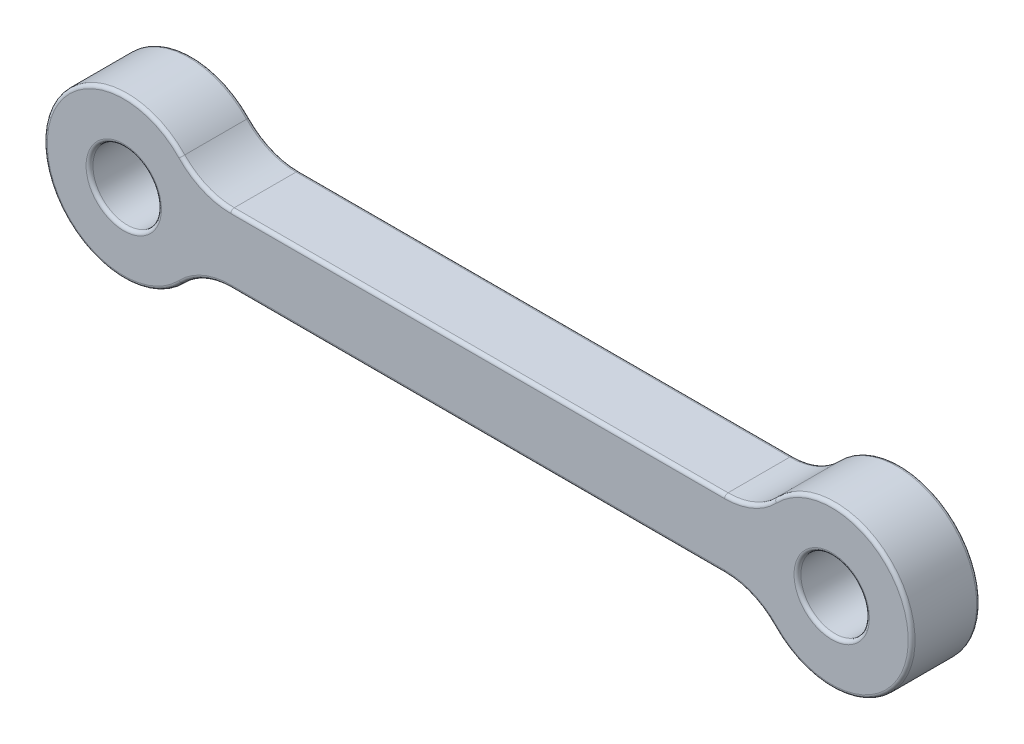
ISO-10303-21;
HEADER;
FILE_DESCRIPTION(('STEP AP214'),'2;1');
FILE_NAME('part.step','',(''),(''),'','','');
FILE_SCHEMA(('AUTOMOTIVE_DESIGN { 1 0 10303 214 1 1 1 1 }'));
ENDSEC;
DATA;
#1=APPLICATION_CONTEXT('core data for automotive mechanical design processes');
#2=APPLICATION_PROTOCOL_DEFINITION('international standard','automotive_design',2000,#1);
#3=PRODUCT_CONTEXT('',#1,'mechanical');
#4=PRODUCT('Part','Part','',(#3));
#5=PRODUCT_RELATED_PRODUCT_CATEGORY('part','',(#4));
#6=PRODUCT_DEFINITION_FORMATION('','',#4);
#7=PRODUCT_DEFINITION_CONTEXT('part definition',#1,'design');
#8=PRODUCT_DEFINITION('design','',#6,#7);
#9=PRODUCT_DEFINITION_SHAPE('','',#8);
#10=(LENGTH_UNIT() NAMED_UNIT(*) SI_UNIT(.MILLI.,.METRE.));
#11=(NAMED_UNIT(*) PLANE_ANGLE_UNIT() SI_UNIT($,.RADIAN.));
#12=(NAMED_UNIT(*) SI_UNIT($,.STERADIAN.) SOLID_ANGLE_UNIT());
#13=UNCERTAINTY_MEASURE_WITH_UNIT(LENGTH_MEASURE(1.E-05),#10,'distance_accuracy_value','');
#14=(GEOMETRIC_REPRESENTATION_CONTEXT(3) GLOBAL_UNCERTAINTY_ASSIGNED_CONTEXT((#13)) GLOBAL_UNIT_ASSIGNED_CONTEXT((#10,
#11,#12)) REPRESENTATION_CONTEXT('',''));
#15=CARTESIAN_POINT('',(0.,0.,0.));
#16=DIRECTION('',(0.,0.,1.));
#17=DIRECTION('',(1.,0.,0.));
#18=AXIS2_PLACEMENT_3D('',#15,#16,#17);
#19=CARTESIAN_POINT('',(0.,1.5,1.5));
#20=DIRECTION('',(0.,1.,0.));
#21=DIRECTION('',(0.,0.,1.));
#22=AXIS2_PLACEMENT_3D('',#19,#20,#21);
#23=PLANE('',#22);
#24=DIRECTION('',(0.,0.,1.));
#25=VECTOR('',#24,1.);
#26=CARTESIAN_POINT('',(26.3095842401766,1.5,-1.5));
#27=LINE('',#26,#25);
#28=CARTESIAN_POINT('',(26.3095842401766,1.5,1.35));
#29=VERTEX_POINT('',#28);
#30=CARTESIAN_POINT('',(26.3095842401766,1.5,-1.35));
#31=VERTEX_POINT('',#30);
#32=EDGE_CURVE('E317',#29,#31,#27,.F.);
#33=ORIENTED_EDGE('',*,*,#32,.T.);
#34=DIRECTION('',(1.,0.,0.));
#35=VECTOR('',#34,1.);
#36=CARTESIAN_POINT('',(4.69041575982343,1.5,-1.35));
#37=LINE('',#36,#35);
#38=CARTESIAN_POINT('',(4.69041575982343,1.5,-1.35));
#39=VERTEX_POINT('',#38);
#40=EDGE_CURVE('E216',#31,#39,#37,.F.);
#41=ORIENTED_EDGE('',*,*,#40,.T.);
#42=DIRECTION('',(0.,0.,-1.));
#43=VECTOR('',#42,1.);
#44=CARTESIAN_POINT('',(4.69041575982343,1.5,1.5));
#45=LINE('',#44,#43);
#46=CARTESIAN_POINT('',(4.69041575982343,1.5,1.35));
#47=VERTEX_POINT('',#46);
#48=EDGE_CURVE('E314',#39,#47,#45,.F.);
#49=ORIENTED_EDGE('',*,*,#48,.T.);
#50=DIRECTION('',(1.,0.,0.));
#51=VECTOR('',#50,1.);
#52=CARTESIAN_POINT('',(0.,1.5,1.35));
#53=LINE('',#52,#51);
#54=EDGE_CURVE('E214',#47,#29,#53,.T.);
#55=ORIENTED_EDGE('',*,*,#54,.T.);
#56=EDGE_LOOP('',(#33,#41,#49,#55));
#57=FACE_BOUND('',#56,.T.);
#58=ADVANCED_FACE('F36',(#57),#23,.T.);
#59=CARTESIAN_POINT('',(0.,0.,1.5));
#60=DIRECTION('',(0.,0.,-1.));
#61=DIRECTION('',(-1.,0.,0.));
#62=AXIS2_PLACEMENT_3D('',#59,#60,#61);
#63=CYLINDRICAL_SURFACE('',#62,3.5);
#64=DIRECTION('',(0.,0.,-1.));
#65=VECTOR('',#64,1.);
#66=CARTESIAN_POINT('',(2.52560848605877,2.42307692307692,1.5));
#67=LINE('',#66,#65);
#68=CARTESIAN_POINT('',(2.52560848605877,2.42307692307692,1.35));
#69=VERTEX_POINT('',#68);
#70=CARTESIAN_POINT('',(2.52560848605877,2.42307692307692,-1.35));
#71=VERTEX_POINT('',#70);
#72=EDGE_CURVE('E304',#69,#71,#67,.T.);
#73=ORIENTED_EDGE('',*,*,#72,.T.);
#74=CARTESIAN_POINT('',(0.,0.,-1.35));
#75=DIRECTION('',(0.,0.,1.));
#76=DIRECTION('',(1.,0.,0.));
#77=AXIS2_PLACEMENT_3D('',#74,#75,#76);
#78=CIRCLE('',#77,3.5);
#79=CARTESIAN_POINT('',(2.52560848605877,-2.42307692307692,-1.35));
#80=VERTEX_POINT('',#79);
#81=EDGE_CURVE('E224',#71,#80,#78,.T.);
#82=ORIENTED_EDGE('',*,*,#81,.T.);
#83=DIRECTION('',(0.,0.,-1.));
#84=VECTOR('',#83,1.);
#85=CARTESIAN_POINT('',(2.52560848605877,-2.42307692307692,1.5));
#86=LINE('',#85,#84);
#87=CARTESIAN_POINT('',(2.52560848605877,-2.42307692307692,1.35));
#88=VERTEX_POINT('',#87);
#89=EDGE_CURVE('E296',#80,#88,#86,.F.);
#90=ORIENTED_EDGE('',*,*,#89,.T.);
#91=CARTESIAN_POINT('',(0.,0.,1.35));
#92=DIRECTION('',(0.,0.,1.));
#93=DIRECTION('',(1.,0.,0.));
#94=AXIS2_PLACEMENT_3D('',#91,#92,#93);
#95=CIRCLE('',#94,3.5);
#96=EDGE_CURVE('E222',#88,#69,#95,.F.);
#97=ORIENTED_EDGE('',*,*,#96,.T.);
#98=EDGE_LOOP('',(#73,#82,#90,#97));
#99=FACE_BOUND('',#98,.T.);
#100=ADVANCED_FACE('F301',(#99),#63,.T.);
#101=CARTESIAN_POINT('',(0.,-1.5,1.5));
#102=DIRECTION('',(0.,1.,0.));
#103=DIRECTION('',(0.,0.,1.));
#104=AXIS2_PLACEMENT_3D('',#101,#102,#103);
#105=PLANE('',#104);
#106=DIRECTION('',(0.,0.,1.));
#107=VECTOR('',#106,1.);
#108=CARTESIAN_POINT('',(4.69041575982343,-1.5,-1.5));
#109=LINE('',#108,#107);
#110=CARTESIAN_POINT('',(4.69041575982343,-1.5,1.35));
#111=VERTEX_POINT('',#110);
#112=CARTESIAN_POINT('',(4.69041575982343,-1.5,-1.35));
#113=VERTEX_POINT('',#112);
#114=EDGE_CURVE('E298',#111,#113,#109,.F.);
#115=ORIENTED_EDGE('',*,*,#114,.T.);
#116=DIRECTION('',(1.,0.,0.));
#117=VECTOR('',#116,1.);
#118=CARTESIAN_POINT('',(0.,-1.5,-1.35));
#119=LINE('',#118,#117);
#120=CARTESIAN_POINT('',(26.3095842401766,-1.5,-1.35));
#121=VERTEX_POINT('',#120);
#122=EDGE_CURVE('E199',#113,#121,#119,.T.);
#123=ORIENTED_EDGE('',*,*,#122,.T.);
#124=DIRECTION('',(0.,0.,-1.));
#125=VECTOR('',#124,1.);
#126=CARTESIAN_POINT('',(26.3095842401766,-1.5,1.5));
#127=LINE('',#126,#125);
#128=CARTESIAN_POINT('',(26.3095842401766,-1.5,1.35));
#129=VERTEX_POINT('',#128);
#130=EDGE_CURVE('E259',#121,#129,#127,.F.);
#131=ORIENTED_EDGE('',*,*,#130,.T.);
#132=DIRECTION('',(1.,0.,0.));
#133=VECTOR('',#132,1.);
#134=CARTESIAN_POINT('',(4.69041575982343,-1.5,1.35));
#135=LINE('',#134,#133);
#136=EDGE_CURVE('E197',#129,#111,#135,.F.);
#137=ORIENTED_EDGE('',*,*,#136,.T.);
#138=EDGE_LOOP('',(#115,#123,#131,#137));
#139=FACE_BOUND('',#138,.T.);
#140=ADVANCED_FACE('F344',(#139),#105,.F.);
#141=CARTESIAN_POINT('',(0.,0.,1.5));
#142=DIRECTION('',(0.,0.,-1.));
#143=DIRECTION('',(-1.,0.,0.));
#144=AXIS2_PLACEMENT_3D('',#141,#142,#143);
#145=CYLINDRICAL_SURFACE('',#144,1.5);
#146=CARTESIAN_POINT('',(0.,0.,-1.35));
#147=DIRECTION('',(0.,0.,1.));
#148=DIRECTION('',(1.,0.,0.));
#149=AXIS2_PLACEMENT_3D('',#146,#147,#148);
#150=CIRCLE('',#149,1.5);
#151=CARTESIAN_POINT('',(1.5,0.,-1.35));
#152=VERTEX_POINT('',#151);
#153=EDGE_CURVE('E191',#152,#152,#150,.F.);
#154=ORIENTED_EDGE('',*,*,#153,.T.);
#155=EDGE_LOOP('',(#154));
#156=FACE_BOUND('',#155,.T.);
#157=CARTESIAN_POINT('',(0.,0.,1.35));
#158=DIRECTION('',(0.,0.,1.));
#159=DIRECTION('',(1.,0.,0.));
#160=AXIS2_PLACEMENT_3D('',#157,#158,#159);
#161=CIRCLE('',#160,1.5);
#162=CARTESIAN_POINT('',(1.5,0.,1.35));
#163=VERTEX_POINT('',#162);
#164=EDGE_CURVE('E188',#163,#163,#161,.T.);
#165=ORIENTED_EDGE('',*,*,#164,.T.);
#166=EDGE_LOOP('',(#165));
#167=FACE_BOUND('',#166,.T.);
#168=ADVANCED_FACE('F391',(#156,#167),#145,.F.);
#169=CARTESIAN_POINT('',(31.,0.,1.5));
#170=DIRECTION('',(0.,0.,-1.));
#171=DIRECTION('',(-1.,0.,0.));
#172=AXIS2_PLACEMENT_3D('',#169,#170,#171);
#173=CYLINDRICAL_SURFACE('',#172,3.5);
#174=DIRECTION('',(0.,0.,-1.));
#175=VECTOR('',#174,1.);
#176=CARTESIAN_POINT('',(28.4743915139412,-2.42307692307692,1.5));
#177=LINE('',#176,#175);
#178=CARTESIAN_POINT('',(28.4743915139412,-2.42307692307692,1.35));
#179=VERTEX_POINT('',#178);
#180=CARTESIAN_POINT('',(28.4743915139412,-2.42307692307692,-1.35));
#181=VERTEX_POINT('',#180);
#182=EDGE_CURVE('E307',#179,#181,#177,.T.);
#183=ORIENTED_EDGE('',*,*,#182,.T.);
#184=CARTESIAN_POINT('',(31.,0.,-1.35));
#185=DIRECTION('',(0.,0.,1.));
#186=DIRECTION('',(1.,0.,0.));
#187=AXIS2_PLACEMENT_3D('',#184,#185,#186);
#188=CIRCLE('',#187,3.5);
#189=CARTESIAN_POINT('',(28.4743915139412,2.42307692307692,-1.35));
#190=VERTEX_POINT('',#189);
#191=EDGE_CURVE('E207',#181,#190,#188,.T.);
#192=ORIENTED_EDGE('',*,*,#191,.T.);
#193=DIRECTION('',(0.,0.,-1.));
#194=VECTOR('',#193,1.);
#195=CARTESIAN_POINT('',(28.4743915139412,2.42307692307692,1.5));
#196=LINE('',#195,#194);
#197=CARTESIAN_POINT('',(28.4743915139412,2.42307692307692,1.35));
#198=VERTEX_POINT('',#197);
#199=EDGE_CURVE('E303',#190,#198,#196,.F.);
#200=ORIENTED_EDGE('',*,*,#199,.T.);
#201=CARTESIAN_POINT('',(31.,0.,1.35));
#202=DIRECTION('',(0.,0.,1.));
#203=DIRECTION('',(1.,0.,0.));
#204=AXIS2_PLACEMENT_3D('',#201,#202,#203);
#205=CIRCLE('',#204,3.5);
#206=EDGE_CURVE('E205',#198,#179,#205,.F.);
#207=ORIENTED_EDGE('',*,*,#206,.T.);
#208=EDGE_LOOP('',(#183,#192,#200,#207));
#209=FACE_BOUND('',#208,.T.);
#210=ADVANCED_FACE('F388',(#209),#173,.T.);
#211=CARTESIAN_POINT('',(31.,0.,1.5));
#212=DIRECTION('',(0.,0.,-1.));
#213=DIRECTION('',(-1.,0.,0.));
#214=AXIS2_PLACEMENT_3D('',#211,#212,#213);
#215=CYLINDRICAL_SURFACE('',#214,1.5);
#216=CARTESIAN_POINT('',(31.,0.,-1.35));
#217=DIRECTION('',(0.,0.,1.));
#218=DIRECTION('',(1.,0.,0.));
#219=AXIS2_PLACEMENT_3D('',#216,#217,#218);
#220=CIRCLE('',#219,1.5);
#221=CARTESIAN_POINT('',(32.5,0.,-1.35));
#222=VERTEX_POINT('',#221);
#223=EDGE_CURVE('E171',#222,#222,#220,.F.);
#224=ORIENTED_EDGE('',*,*,#223,.T.);
#225=EDGE_LOOP('',(#224));
#226=FACE_BOUND('',#225,.T.);
#227=CARTESIAN_POINT('',(31.,0.,1.35));
#228=DIRECTION('',(0.,0.,1.));
#229=DIRECTION('',(1.,0.,0.));
#230=AXIS2_PLACEMENT_3D('',#227,#228,#229);
#231=CIRCLE('',#230,1.5);
#232=CARTESIAN_POINT('',(32.5,0.,1.35));
#233=VERTEX_POINT('',#232);
#234=EDGE_CURVE('E320',#233,#233,#231,.T.);
#235=ORIENTED_EDGE('',*,*,#234,.T.);
#236=EDGE_LOOP('',(#235));
#237=FACE_BOUND('',#236,.T.);
#238=ADVANCED_FACE('F390',(#226,#237),#215,.F.);
#239=CARTESIAN_POINT('',(0.,0.,1.5));
#240=DIRECTION('',(0.,0.,1.));
#241=DIRECTION('',(1.,0.,0.));
#242=AXIS2_PLACEMENT_3D('',#239,#240,#241);
#243=PLANE('',#242);
#244=CARTESIAN_POINT('',(31.,0.,1.5));
#245=DIRECTION('',(0.,0.,1.));
#246=DIRECTION('',(1.,0.,0.));
#247=AXIS2_PLACEMENT_3D('',#244,#245,#246);
#248=CIRCLE('',#247,1.65);
#249=CARTESIAN_POINT('',(32.65,0.,1.5));
#250=VERTEX_POINT('',#249);
#251=EDGE_CURVE('E11',#250,#250,#248,.F.);
#252=ORIENTED_EDGE('',*,*,#251,.T.);
#253=EDGE_LOOP('',(#252));
#254=FACE_BOUND('',#253,.T.);
#255=CARTESIAN_POINT('',(0.,0.,1.5));
#256=DIRECTION('',(0.,0.,1.));
#257=DIRECTION('',(1.,0.,0.));
#258=AXIS2_PLACEMENT_3D('',#255,#256,#257);
#259=CIRCLE('',#258,1.65);
#260=CARTESIAN_POINT('',(1.65,0.,1.5));
#261=VERTEX_POINT('',#260);
#262=EDGE_CURVE('E45',#261,#261,#259,.F.);
#263=ORIENTED_EDGE('',*,*,#262,.T.);
#264=EDGE_LOOP('',(#263));
#265=FACE_BOUND('',#264,.T.);
#266=CARTESIAN_POINT('',(31.,0.,1.5));
#267=DIRECTION('',(0.,0.,1.));
#268=DIRECTION('',(1.,0.,0.));
#269=AXIS2_PLACEMENT_3D('',#266,#267,#268);
#270=CIRCLE('',#269,3.35);
#271=CARTESIAN_POINT('',(28.5826318776295,-2.31923076923077,1.5));
#272=VERTEX_POINT('',#271);
#273=CARTESIAN_POINT('',(28.5826318776295,2.31923076923077,1.5));
#274=VERTEX_POINT('',#273);
#275=EDGE_CURVE('E53',#272,#274,#270,.T.);
#276=ORIENTED_EDGE('',*,*,#275,.T.);
#277=CARTESIAN_POINT('',(26.3095842401766,4.5,1.5));
#278=DIRECTION('',(0.,0.,1.));
#279=DIRECTION('',(1.,0.,0.));
#280=AXIS2_PLACEMENT_3D('',#277,#278,#279);
#281=CIRCLE('',#280,3.15);
#282=CARTESIAN_POINT('',(26.3095842401766,1.35,1.5));
#283=VERTEX_POINT('',#282);
#284=EDGE_CURVE('E238',#274,#283,#281,.F.);
#285=ORIENTED_EDGE('',*,*,#284,.T.);
#286=DIRECTION('',(1.,0.,0.));
#287=VECTOR('',#286,1.);
#288=CARTESIAN_POINT('',(0.,1.35,1.5));
#289=LINE('',#288,#287);
#290=CARTESIAN_POINT('',(4.69041575982343,1.35,1.5));
#291=VERTEX_POINT('',#290);
#292=EDGE_CURVE('E226',#283,#291,#289,.F.);
#293=ORIENTED_EDGE('',*,*,#292,.T.);
#294=CARTESIAN_POINT('',(4.69041575982343,4.5,1.5));
#295=DIRECTION('',(0.,0.,1.));
#296=DIRECTION('',(1.,0.,0.));
#297=AXIS2_PLACEMENT_3D('',#294,#295,#296);
#298=CIRCLE('',#297,3.15);
#299=CARTESIAN_POINT('',(2.41736812237054,2.31923076923077,1.5));
#300=VERTEX_POINT('',#299);
#301=EDGE_CURVE('E228',#291,#300,#298,.F.);
#302=ORIENTED_EDGE('',*,*,#301,.T.);
#303=CARTESIAN_POINT('',(0.,0.,1.5));
#304=DIRECTION('',(0.,0.,1.));
#305=DIRECTION('',(1.,0.,0.));
#306=AXIS2_PLACEMENT_3D('',#303,#304,#305);
#307=CIRCLE('',#306,3.35);
#308=CARTESIAN_POINT('',(2.41736812237054,-2.31923076923077,1.5));
#309=VERTEX_POINT('',#308);
#310=EDGE_CURVE('E230',#300,#309,#307,.T.);
#311=ORIENTED_EDGE('',*,*,#310,.T.);
#312=CARTESIAN_POINT('',(4.69041575982343,-4.5,1.5));
#313=DIRECTION('',(0.,0.,1.));
#314=DIRECTION('',(1.,0.,0.));
#315=AXIS2_PLACEMENT_3D('',#312,#313,#314);
#316=CIRCLE('',#315,3.15);
#317=CARTESIAN_POINT('',(4.69041575982343,-1.35,1.5));
#318=VERTEX_POINT('',#317);
#319=EDGE_CURVE('E232',#309,#318,#316,.F.);
#320=ORIENTED_EDGE('',*,*,#319,.T.);
#321=DIRECTION('',(1.,0.,0.));
#322=VECTOR('',#321,1.);
#323=CARTESIAN_POINT('',(26.3095842401766,-1.35,1.5));
#324=LINE('',#323,#322);
#325=CARTESIAN_POINT('',(26.3095842401766,-1.35,1.5));
#326=VERTEX_POINT('',#325);
#327=EDGE_CURVE('E234',#318,#326,#324,.T.);
#328=ORIENTED_EDGE('',*,*,#327,.T.);
#329=CARTESIAN_POINT('',(26.3095842401766,-4.5,1.5));
#330=DIRECTION('',(0.,0.,1.));
#331=DIRECTION('',(1.,0.,0.));
#332=AXIS2_PLACEMENT_3D('',#329,#330,#331);
#333=CIRCLE('',#332,3.15);
#334=EDGE_CURVE('E58',#326,#272,#333,.F.);
#335=ORIENTED_EDGE('',*,*,#334,.T.);
#336=EDGE_LOOP('',(#276,#285,#293,#302,#311,#320,#328,#335));
#337=FACE_BOUND('',#336,.T.);
#338=ADVANCED_FACE('F361',(#254,#265,#337),#243,.T.);
#339=CARTESIAN_POINT('',(0.,0.,-1.5));
#340=DIRECTION('',(0.,0.,1.));
#341=DIRECTION('',(1.,0.,0.));
#342=AXIS2_PLACEMENT_3D('',#339,#340,#341);
#343=PLANE('',#342);
#344=CARTESIAN_POINT('',(31.,0.,-1.5));
#345=DIRECTION('',(0.,0.,1.));
#346=DIRECTION('',(1.,0.,0.));
#347=AXIS2_PLACEMENT_3D('',#344,#345,#346);
#348=CIRCLE('',#347,1.65);
#349=CARTESIAN_POINT('',(32.65,0.,-1.5));
#350=VERTEX_POINT('',#349);
#351=EDGE_CURVE('E180',#350,#350,#348,.T.);
#352=ORIENTED_EDGE('',*,*,#351,.T.);
#353=EDGE_LOOP('',(#352));
#354=FACE_BOUND('',#353,.T.);
#355=CARTESIAN_POINT('',(0.,0.,-1.5));
#356=DIRECTION('',(0.,0.,1.));
#357=DIRECTION('',(1.,0.,0.));
#358=AXIS2_PLACEMENT_3D('',#355,#356,#357);
#359=CIRCLE('',#358,1.65);
#360=CARTESIAN_POINT('',(1.65,0.,-1.5));
#361=VERTEX_POINT('',#360);
#362=EDGE_CURVE('E177',#361,#361,#359,.T.);
#363=ORIENTED_EDGE('',*,*,#362,.T.);
#364=EDGE_LOOP('',(#363));
#365=FACE_BOUND('',#364,.T.);
#366=DIRECTION('',(1.,0.,0.));
#367=VECTOR('',#366,1.);
#368=CARTESIAN_POINT('',(0.,-1.35,-1.5));
#369=LINE('',#368,#367);
#370=CARTESIAN_POINT('',(26.3095842401766,-1.35,-1.5));
#371=VERTEX_POINT('',#370);
#372=CARTESIAN_POINT('',(4.69041575982343,-1.35,-1.5));
#373=VERTEX_POINT('',#372);
#374=EDGE_CURVE('E175',#371,#373,#369,.F.);
#375=ORIENTED_EDGE('',*,*,#374,.T.);
#376=CARTESIAN_POINT('',(4.69041575982343,-4.5,-1.5));
#377=DIRECTION('',(0.,0.,1.));
#378=DIRECTION('',(1.,0.,0.));
#379=AXIS2_PLACEMENT_3D('',#376,#377,#378);
#380=CIRCLE('',#379,3.15);
#381=CARTESIAN_POINT('',(2.41736812237054,-2.31923076923077,-1.5));
#382=VERTEX_POINT('',#381);
#383=EDGE_CURVE('E156',#373,#382,#380,.T.);
#384=ORIENTED_EDGE('',*,*,#383,.T.);
#385=CARTESIAN_POINT('',(0.,0.,-1.5));
#386=DIRECTION('',(0.,0.,1.));
#387=DIRECTION('',(1.,0.,0.));
#388=AXIS2_PLACEMENT_3D('',#385,#386,#387);
#389=CIRCLE('',#388,3.35);
#390=CARTESIAN_POINT('',(2.41736812237054,2.31923076923077,-1.5));
#391=VERTEX_POINT('',#390);
#392=EDGE_CURVE('E164',#382,#391,#389,.F.);
#393=ORIENTED_EDGE('',*,*,#392,.T.);
#394=CARTESIAN_POINT('',(4.69041575982343,4.5,-1.5));
#395=DIRECTION('',(0.,0.,1.));
#396=DIRECTION('',(1.,0.,0.));
#397=AXIS2_PLACEMENT_3D('',#394,#395,#396);
#398=CIRCLE('',#397,3.15);
#399=CARTESIAN_POINT('',(4.69041575982343,1.35,-1.5));
#400=VERTEX_POINT('',#399);
#401=EDGE_CURVE('E170',#391,#400,#398,.T.);
#402=ORIENTED_EDGE('',*,*,#401,.T.);
#403=DIRECTION('',(1.,0.,0.));
#404=VECTOR('',#403,1.);
#405=CARTESIAN_POINT('',(26.3095842401766,1.35,-1.5));
#406=LINE('',#405,#404);
#407=CARTESIAN_POINT('',(26.3095842401766,1.35,-1.5));
#408=VERTEX_POINT('',#407);
#409=EDGE_CURVE('E326',#400,#408,#406,.T.);
#410=ORIENTED_EDGE('',*,*,#409,.T.);
#411=CARTESIAN_POINT('',(26.3095842401766,4.5,-1.5));
#412=DIRECTION('',(0.,0.,1.));
#413=DIRECTION('',(1.,0.,0.));
#414=AXIS2_PLACEMENT_3D('',#411,#412,#413);
#415=CIRCLE('',#414,3.15);
#416=CARTESIAN_POINT('',(28.5826318776295,2.31923076923077,-1.5));
#417=VERTEX_POINT('',#416);
#418=EDGE_CURVE('E328',#408,#417,#415,.T.);
#419=ORIENTED_EDGE('',*,*,#418,.T.);
#420=CARTESIAN_POINT('',(31.,0.,-1.5));
#421=DIRECTION('',(0.,0.,1.));
#422=DIRECTION('',(1.,0.,0.));
#423=AXIS2_PLACEMENT_3D('',#420,#421,#422);
#424=CIRCLE('',#423,3.35);
#425=CARTESIAN_POINT('',(28.5826318776295,-2.31923076923077,-1.5));
#426=VERTEX_POINT('',#425);
#427=EDGE_CURVE('E330',#417,#426,#424,.F.);
#428=ORIENTED_EDGE('',*,*,#427,.T.);
#429=CARTESIAN_POINT('',(26.3095842401766,-4.5,-1.5));
#430=DIRECTION('',(0.,0.,1.));
#431=DIRECTION('',(1.,0.,0.));
#432=AXIS2_PLACEMENT_3D('',#429,#430,#431);
#433=CIRCLE('',#432,3.15);
#434=EDGE_CURVE('E182',#426,#371,#433,.T.);
#435=ORIENTED_EDGE('',*,*,#434,.T.);
#436=EDGE_LOOP('',(#375,#384,#393,#402,#410,#419,#428,#435));
#437=FACE_BOUND('',#436,.T.);
#438=ADVANCED_FACE('F173',(#354,#365,#437),#343,.F.);
#439=CARTESIAN_POINT('',(4.69041575982343,-4.5,1.5));
#440=DIRECTION('',(0.,0.,-1.));
#441=DIRECTION('',(-1.,0.,0.));
#442=AXIS2_PLACEMENT_3D('',#439,#440,#441);
#443=CYLINDRICAL_SURFACE('',#442,3.);
#444=ORIENTED_EDGE('',*,*,#89,.F.);
#445=CARTESIAN_POINT('',(4.69041575982343,-4.5,-1.35));
#446=DIRECTION('',(0.,0.,1.));
#447=DIRECTION('',(1.,0.,0.));
#448=AXIS2_PLACEMENT_3D('',#445,#446,#447);
#449=CIRCLE('',#448,3.);
#450=EDGE_CURVE('E158',#80,#113,#449,.F.);
#451=ORIENTED_EDGE('',*,*,#450,.T.);
#452=ORIENTED_EDGE('',*,*,#114,.F.);
#453=CARTESIAN_POINT('',(4.69041575982343,-4.5,1.35));
#454=DIRECTION('',(0.,0.,1.));
#455=DIRECTION('',(1.,0.,0.));
#456=AXIS2_PLACEMENT_3D('',#453,#454,#455);
#457=CIRCLE('',#456,3.);
#458=EDGE_CURVE('E194',#111,#88,#457,.T.);
#459=ORIENTED_EDGE('',*,*,#458,.T.);
#460=EDGE_LOOP('',(#444,#451,#452,#459));
#461=FACE_BOUND('',#460,.T.);
#462=ADVANCED_FACE('F295',(#461),#443,.F.);
#463=CARTESIAN_POINT('',(26.3095842401766,-4.5,1.5));
#464=DIRECTION('',(0.,0.,-1.));
#465=DIRECTION('',(-1.,0.,0.));
#466=AXIS2_PLACEMENT_3D('',#463,#464,#465);
#467=CYLINDRICAL_SURFACE('',#466,3.);
#468=ORIENTED_EDGE('',*,*,#130,.F.);
#469=CARTESIAN_POINT('',(26.3095842401766,-4.5,-1.35));
#470=DIRECTION('',(0.,0.,1.));
#471=DIRECTION('',(1.,0.,0.));
#472=AXIS2_PLACEMENT_3D('',#469,#470,#471);
#473=CIRCLE('',#472,3.);
#474=EDGE_CURVE('E203',#121,#181,#473,.F.);
#475=ORIENTED_EDGE('',*,*,#474,.T.);
#476=ORIENTED_EDGE('',*,*,#182,.F.);
#477=CARTESIAN_POINT('',(26.3095842401766,-4.5,1.35));
#478=DIRECTION('',(0.,0.,1.));
#479=DIRECTION('',(1.,0.,0.));
#480=AXIS2_PLACEMENT_3D('',#477,#478,#479);
#481=CIRCLE('',#480,3.);
#482=EDGE_CURVE('E201',#179,#129,#481,.T.);
#483=ORIENTED_EDGE('',*,*,#482,.T.);
#484=EDGE_LOOP('',(#468,#475,#476,#483));
#485=FACE_BOUND('',#484,.T.);
#486=ADVANCED_FACE('F347',(#485),#467,.F.);
#487=CARTESIAN_POINT('',(26.3095842401766,4.5,1.5));
#488=DIRECTION('',(0.,0.,-1.));
#489=DIRECTION('',(-1.,0.,0.));
#490=AXIS2_PLACEMENT_3D('',#487,#488,#489);
#491=CYLINDRICAL_SURFACE('',#490,3.);
#492=ORIENTED_EDGE('',*,*,#199,.F.);
#493=CARTESIAN_POINT('',(26.3095842401766,4.5,-1.35));
#494=DIRECTION('',(0.,0.,1.));
#495=DIRECTION('',(1.,0.,0.));
#496=AXIS2_PLACEMENT_3D('',#493,#494,#495);
#497=CIRCLE('',#496,3.);
#498=EDGE_CURVE('E212',#190,#31,#497,.F.);
#499=ORIENTED_EDGE('',*,*,#498,.T.);
#500=ORIENTED_EDGE('',*,*,#32,.F.);
#501=CARTESIAN_POINT('',(26.3095842401766,4.5,1.35));
#502=DIRECTION('',(0.,0.,1.));
#503=DIRECTION('',(1.,0.,0.));
#504=AXIS2_PLACEMENT_3D('',#501,#502,#503);
#505=CIRCLE('',#504,3.);
#506=EDGE_CURVE('E209',#29,#198,#505,.T.);
#507=ORIENTED_EDGE('',*,*,#506,.T.);
#508=EDGE_LOOP('',(#492,#499,#500,#507));
#509=FACE_BOUND('',#508,.T.);
#510=ADVANCED_FACE('F377',(#509),#491,.F.);
#511=CARTESIAN_POINT('',(4.69041575982343,4.5,1.5));
#512=DIRECTION('',(0.,0.,-1.));
#513=DIRECTION('',(-1.,0.,0.));
#514=AXIS2_PLACEMENT_3D('',#511,#512,#513);
#515=CYLINDRICAL_SURFACE('',#514,3.);
#516=ORIENTED_EDGE('',*,*,#48,.F.);
#517=CARTESIAN_POINT('',(4.69041575982343,4.5,-1.35));
#518=DIRECTION('',(0.,0.,1.));
#519=DIRECTION('',(1.,0.,0.));
#520=AXIS2_PLACEMENT_3D('',#517,#518,#519);
#521=CIRCLE('',#520,3.);
#522=EDGE_CURVE('E220',#39,#71,#521,.F.);
#523=ORIENTED_EDGE('',*,*,#522,.T.);
#524=ORIENTED_EDGE('',*,*,#72,.F.);
#525=CARTESIAN_POINT('',(4.69041575982343,4.5,1.35));
#526=DIRECTION('',(0.,0.,1.));
#527=DIRECTION('',(1.,0.,0.));
#528=AXIS2_PLACEMENT_3D('',#525,#526,#527);
#529=CIRCLE('',#528,3.);
#530=EDGE_CURVE('E218',#69,#47,#529,.T.);
#531=ORIENTED_EDGE('',*,*,#530,.T.);
#532=EDGE_LOOP('',(#516,#523,#524,#531));
#533=FACE_BOUND('',#532,.T.);
#534=ADVANCED_FACE('F415',(#533),#515,.F.);
#535=CARTESIAN_POINT('',(31.,0.,-1.35));
#536=DIRECTION('',(0.,0.,1.));
#537=DIRECTION('',(1.,0.,0.));
#538=AXIS2_PLACEMENT_3D('',#535,#536,#537);
#539=TOROIDAL_SURFACE('',#538,1.65,0.15);
#540=ORIENTED_EDGE('',*,*,#351,.F.);
#541=EDGE_LOOP('',(#540));
#542=FACE_BOUND('',#541,.T.);
#543=ORIENTED_EDGE('',*,*,#223,.F.);
#544=EDGE_LOOP('',(#543));
#545=FACE_BOUND('',#544,.T.);
#546=ADVANCED_FACE('F418',(#542,#545),#539,.T.);
#547=CARTESIAN_POINT('',(0.,0.,-1.35));
#548=DIRECTION('',(0.,0.,1.));
#549=DIRECTION('',(1.,0.,0.));
#550=AXIS2_PLACEMENT_3D('',#547,#548,#549);
#551=TOROIDAL_SURFACE('',#550,1.65,0.15);
#552=ORIENTED_EDGE('',*,*,#153,.F.);
#553=EDGE_LOOP('',(#552));
#554=FACE_BOUND('',#553,.T.);
#555=ORIENTED_EDGE('',*,*,#362,.F.);
#556=EDGE_LOOP('',(#555));
#557=FACE_BOUND('',#556,.T.);
#558=ADVANCED_FACE('F422',(#554,#557),#551,.T.);
#559=CARTESIAN_POINT('',(26.3095842401766,4.5,-1.35));
#560=DIRECTION('',(0.,0.,1.));
#561=DIRECTION('',(1.,0.,0.));
#562=AXIS2_PLACEMENT_3D('',#559,#560,#561);
#563=TOROIDAL_SURFACE('',#562,3.15,0.15);
#564=CARTESIAN_POINT('',(26.3095842401766,1.35,-1.35));
#565=DIRECTION('',(-1.,0.,0.));
#566=DIRECTION('',(0.,0.,1.));
#567=AXIS2_PLACEMENT_3D('',#564,#565,#566);
#568=CIRCLE('',#567,0.15);
#569=EDGE_CURVE('E253',#31,#408,#568,.T.);
#570=ORIENTED_EDGE('',*,*,#569,.F.);
#571=ORIENTED_EDGE('',*,*,#498,.F.);
#572=CARTESIAN_POINT('',(28.5826318776295,2.31923076923077,-1.35));
#573=DIRECTION('',(0.692307692307703,0.72160242458821,0.));
#574=DIRECTION('',(-0.72160242458821,0.692307692307703,0.));
#575=AXIS2_PLACEMENT_3D('',#572,#573,#574);
#576=CIRCLE('',#575,0.15);
#577=EDGE_CURVE('E256',#417,#190,#576,.T.);
#578=ORIENTED_EDGE('',*,*,#577,.F.);
#579=ORIENTED_EDGE('',*,*,#418,.F.);
#580=EDGE_LOOP('',(#570,#571,#578,#579));
#581=FACE_BOUND('',#580,.T.);
#582=ADVANCED_FACE('F381',(#581),#563,.T.);
#583=CARTESIAN_POINT('',(31.,0.,-1.35));
#584=DIRECTION('',(0.,0.,1.));
#585=DIRECTION('',(1.,0.,0.));
#586=AXIS2_PLACEMENT_3D('',#583,#584,#585);
#587=TOROIDAL_SURFACE('',#586,3.35,0.15);
#588=ORIENTED_EDGE('',*,*,#577,.T.);
#589=ORIENTED_EDGE('',*,*,#191,.F.);
#590=CARTESIAN_POINT('',(28.5826318776295,-2.31923076923077,-1.35));
#591=DIRECTION('',(-0.692307692307698,0.721602424588214,0.));
#592=DIRECTION('',(-0.721602424588214,-0.692307692307698,0.));
#593=AXIS2_PLACEMENT_3D('',#590,#591,#592);
#594=CIRCLE('',#593,0.15);
#595=EDGE_CURVE('E250',#426,#181,#594,.T.);
#596=ORIENTED_EDGE('',*,*,#595,.F.);
#597=ORIENTED_EDGE('',*,*,#427,.F.);
#598=EDGE_LOOP('',(#588,#589,#596,#597));
#599=FACE_BOUND('',#598,.T.);
#600=ADVANCED_FACE('F386',(#599),#587,.T.);
#601=CARTESIAN_POINT('',(0.,1.35,-1.35));
#602=DIRECTION('',(-1.,0.,0.));
#603=DIRECTION('',(0.,0.,1.));
#604=AXIS2_PLACEMENT_3D('',#601,#602,#603);
#605=CYLINDRICAL_SURFACE('',#604,0.15);
#606=ORIENTED_EDGE('',*,*,#569,.T.);
#607=ORIENTED_EDGE('',*,*,#409,.F.);
#608=CARTESIAN_POINT('',(4.69041575982343,1.35,-1.35));
#609=DIRECTION('',(-1.,0.,0.));
#610=DIRECTION('',(0.,0.,1.));
#611=AXIS2_PLACEMENT_3D('',#608,#609,#610);
#612=CIRCLE('',#611,0.15);
#613=EDGE_CURVE('E247',#39,#400,#612,.T.);
#614=ORIENTED_EDGE('',*,*,#613,.F.);
#615=ORIENTED_EDGE('',*,*,#40,.F.);
#616=EDGE_LOOP('',(#606,#607,#614,#615));
#617=FACE_BOUND('',#616,.T.);
#618=ADVANCED_FACE('F440',(#617),#605,.T.);
#619=CARTESIAN_POINT('',(26.3095842401766,-4.5,-1.35));
#620=DIRECTION('',(0.,0.,1.));
#621=DIRECTION('',(1.,0.,0.));
#622=AXIS2_PLACEMENT_3D('',#619,#620,#621);
#623=TOROIDAL_SURFACE('',#622,3.15,0.15);
#624=ORIENTED_EDGE('',*,*,#595,.T.);
#625=ORIENTED_EDGE('',*,*,#474,.F.);
#626=CARTESIAN_POINT('',(26.3095842401766,-1.35,-1.35));
#627=DIRECTION('',(-1.,0.,0.));
#628=DIRECTION('',(0.,0.,1.));
#629=AXIS2_PLACEMENT_3D('',#626,#627,#628);
#630=CIRCLE('',#629,0.15);
#631=EDGE_CURVE('E244',#371,#121,#630,.T.);
#632=ORIENTED_EDGE('',*,*,#631,.F.);
#633=ORIENTED_EDGE('',*,*,#434,.F.);
#634=EDGE_LOOP('',(#624,#625,#632,#633));
#635=FACE_BOUND('',#634,.T.);
#636=ADVANCED_FACE('F337',(#635),#623,.T.);
#637=CARTESIAN_POINT('',(4.69041575982343,4.5,-1.35));
#638=DIRECTION('',(0.,0.,1.));
#639=DIRECTION('',(1.,0.,0.));
#640=AXIS2_PLACEMENT_3D('',#637,#638,#639);
#641=TOROIDAL_SURFACE('',#640,3.15,0.15);
#642=ORIENTED_EDGE('',*,*,#613,.T.);
#643=ORIENTED_EDGE('',*,*,#401,.F.);
#644=CARTESIAN_POINT('',(2.41736812237054,2.31923076923077,-1.35));
#645=DIRECTION('',(-0.692307692307693,0.72160242458822,0.));
#646=DIRECTION('',(-0.72160242458822,-0.692307692307693,0.));
#647=AXIS2_PLACEMENT_3D('',#644,#645,#646);
#648=CIRCLE('',#647,0.15);
#649=EDGE_CURVE('E167',#71,#391,#648,.T.);
#650=ORIENTED_EDGE('',*,*,#649,.F.);
#651=ORIENTED_EDGE('',*,*,#522,.F.);
#652=EDGE_LOOP('',(#642,#643,#650,#651));
#653=FACE_BOUND('',#652,.T.);
#654=ADVANCED_FACE('F434',(#653),#641,.T.);
#655=CARTESIAN_POINT('',(0.,-1.35,-1.35));
#656=DIRECTION('',(1.,0.,0.));
#657=DIRECTION('',(0.,0.,-1.));
#658=AXIS2_PLACEMENT_3D('',#655,#656,#657);
#659=CYLINDRICAL_SURFACE('',#658,0.15);
#660=ORIENTED_EDGE('',*,*,#631,.T.);
#661=ORIENTED_EDGE('',*,*,#122,.F.);
#662=CARTESIAN_POINT('',(4.69041575982343,-1.35,-1.35));
#663=DIRECTION('',(-1.,0.,0.));
#664=DIRECTION('',(0.,0.,1.));
#665=AXIS2_PLACEMENT_3D('',#662,#663,#664);
#666=CIRCLE('',#665,0.15);
#667=EDGE_CURVE('E161',#373,#113,#666,.T.);
#668=ORIENTED_EDGE('',*,*,#667,.F.);
#669=ORIENTED_EDGE('',*,*,#374,.F.);
#670=EDGE_LOOP('',(#660,#661,#668,#669));
#671=FACE_BOUND('',#670,.T.);
#672=ADVANCED_FACE('F340',(#671),#659,.T.);
#673=CARTESIAN_POINT('',(0.,0.,-1.35));
#674=DIRECTION('',(0.,0.,1.));
#675=DIRECTION('',(1.,0.,0.));
#676=AXIS2_PLACEMENT_3D('',#673,#674,#675);
#677=TOROIDAL_SURFACE('',#676,3.35,0.15);
#678=ORIENTED_EDGE('',*,*,#649,.T.);
#679=ORIENTED_EDGE('',*,*,#392,.F.);
#680=CARTESIAN_POINT('',(2.41736812237054,-2.31923076923077,-1.35));
#681=DIRECTION('',(0.692307692307693,0.72160242458822,0.));
#682=DIRECTION('',(-0.72160242458822,0.692307692307693,0.));
#683=AXIS2_PLACEMENT_3D('',#680,#681,#682);
#684=CIRCLE('',#683,0.15);
#685=EDGE_CURVE('E152',#80,#382,#684,.T.);
#686=ORIENTED_EDGE('',*,*,#685,.F.);
#687=ORIENTED_EDGE('',*,*,#81,.F.);
#688=EDGE_LOOP('',(#678,#679,#686,#687));
#689=FACE_BOUND('',#688,.T.);
#690=ADVANCED_FACE('F165',(#689),#677,.T.);
#691=CARTESIAN_POINT('',(4.69041575982343,-4.5,-1.35));
#692=DIRECTION('',(0.,0.,1.));
#693=DIRECTION('',(1.,0.,0.));
#694=AXIS2_PLACEMENT_3D('',#691,#692,#693);
#695=TOROIDAL_SURFACE('',#694,3.15,0.15);
#696=ORIENTED_EDGE('',*,*,#667,.T.);
#697=ORIENTED_EDGE('',*,*,#450,.F.);
#698=ORIENTED_EDGE('',*,*,#685,.T.);
#699=ORIENTED_EDGE('',*,*,#383,.F.);
#700=EDGE_LOOP('',(#696,#697,#698,#699));
#701=FACE_BOUND('',#700,.T.);
#702=ADVANCED_FACE('F154',(#701),#695,.T.);
#703=CARTESIAN_POINT('',(31.,0.,1.35));
#704=DIRECTION('',(0.,0.,1.));
#705=DIRECTION('',(1.,0.,0.));
#706=AXIS2_PLACEMENT_3D('',#703,#704,#705);
#707=TOROIDAL_SURFACE('',#706,1.65,0.15);
#708=ORIENTED_EDGE('',*,*,#234,.F.);
#709=EDGE_LOOP('',(#708));
#710=FACE_BOUND('',#709,.T.);
#711=ORIENTED_EDGE('',*,*,#251,.F.);
#712=EDGE_LOOP('',(#711));
#713=FACE_BOUND('',#712,.T.);
#714=ADVANCED_FACE('F429',(#710,#713),#707,.T.);
#715=CARTESIAN_POINT('',(0.,0.,1.35));
#716=DIRECTION('',(0.,0.,1.));
#717=DIRECTION('',(1.,0.,0.));
#718=AXIS2_PLACEMENT_3D('',#715,#716,#717);
#719=TOROIDAL_SURFACE('',#718,1.65,0.15);
#720=ORIENTED_EDGE('',*,*,#262,.F.);
#721=EDGE_LOOP('',(#720));
#722=FACE_BOUND('',#721,.T.);
#723=ORIENTED_EDGE('',*,*,#164,.F.);
#724=EDGE_LOOP('',(#723));
#725=FACE_BOUND('',#724,.T.);
#726=ADVANCED_FACE('F450',(#722,#725),#719,.T.);
#727=CARTESIAN_POINT('',(4.69041575982343,-4.5,1.35));
#728=DIRECTION('',(0.,0.,1.));
#729=DIRECTION('',(1.,0.,0.));
#730=AXIS2_PLACEMENT_3D('',#727,#728,#729);
#731=TOROIDAL_SURFACE('',#730,3.15,0.15);
#732=CARTESIAN_POINT('',(2.41736812237054,-2.31923076923077,1.35));
#733=DIRECTION('',(-0.692307692307693,-0.72160242458822,0.));
#734=DIRECTION('',(0.72160242458822,-0.692307692307693,0.));
#735=AXIS2_PLACEMENT_3D('',#732,#733,#734);
#736=CIRCLE('',#735,0.15);
#737=EDGE_CURVE('E275',#88,#309,#736,.T.);
#738=ORIENTED_EDGE('',*,*,#737,.F.);
#739=ORIENTED_EDGE('',*,*,#458,.F.);
#740=CARTESIAN_POINT('',(4.69041575982343,-1.35,1.35));
#741=DIRECTION('',(1.,0.,0.));
#742=DIRECTION('',(0.,0.,-1.));
#743=AXIS2_PLACEMENT_3D('',#740,#741,#742);
#744=CIRCLE('',#743,0.15);
#745=EDGE_CURVE('E40',#318,#111,#744,.T.);
#746=ORIENTED_EDGE('',*,*,#745,.F.);
#747=ORIENTED_EDGE('',*,*,#319,.F.);
#748=EDGE_LOOP('',(#738,#739,#746,#747));
#749=FACE_BOUND('',#748,.T.);
#750=ADVANCED_FACE('F38',(#749),#731,.T.);
#751=CARTESIAN_POINT('',(0.,-1.35,1.35));
#752=DIRECTION('',(-1.,0.,0.));
#753=DIRECTION('',(0.,0.,1.));
#754=AXIS2_PLACEMENT_3D('',#751,#752,#753);
#755=CYLINDRICAL_SURFACE('',#754,0.15);
#756=ORIENTED_EDGE('',*,*,#745,.T.);
#757=ORIENTED_EDGE('',*,*,#136,.F.);
#758=CARTESIAN_POINT('',(26.3095842401766,-1.35,1.35));
#759=DIRECTION('',(1.,0.,0.));
#760=DIRECTION('',(0.,0.,-1.));
#761=AXIS2_PLACEMENT_3D('',#758,#759,#760);
#762=CIRCLE('',#761,0.15);
#763=EDGE_CURVE('E273',#326,#129,#762,.T.);
#764=ORIENTED_EDGE('',*,*,#763,.F.);
#765=ORIENTED_EDGE('',*,*,#327,.F.);
#766=EDGE_LOOP('',(#756,#757,#764,#765));
#767=FACE_BOUND('',#766,.T.);
#768=ADVANCED_FACE('F286',(#767),#755,.T.);
#769=CARTESIAN_POINT('',(0.,0.,1.35));
#770=DIRECTION('',(0.,0.,1.));
#771=DIRECTION('',(1.,0.,0.));
#772=AXIS2_PLACEMENT_3D('',#769,#770,#771);
#773=TOROIDAL_SURFACE('',#772,3.35,0.15);
#774=ORIENTED_EDGE('',*,*,#737,.T.);
#775=ORIENTED_EDGE('',*,*,#310,.F.);
#776=CARTESIAN_POINT('',(2.41736812237054,2.31923076923077,1.35));
#777=DIRECTION('',(0.692307692307693,-0.72160242458822,0.));
#778=DIRECTION('',(0.72160242458822,0.692307692307693,0.));
#779=AXIS2_PLACEMENT_3D('',#776,#777,#778);
#780=CIRCLE('',#779,0.15);
#781=EDGE_CURVE('E270',#69,#300,#780,.T.);
#782=ORIENTED_EDGE('',*,*,#781,.F.);
#783=ORIENTED_EDGE('',*,*,#96,.F.);
#784=EDGE_LOOP('',(#774,#775,#782,#783));
#785=FACE_BOUND('',#784,.T.);
#786=ADVANCED_FACE('F465',(#785),#773,.T.);
#787=CARTESIAN_POINT('',(26.3095842401766,-4.5,1.35));
#788=DIRECTION('',(0.,0.,1.));
#789=DIRECTION('',(1.,0.,0.));
#790=AXIS2_PLACEMENT_3D('',#787,#788,#789);
#791=TOROIDAL_SURFACE('',#790,3.15,0.15);
#792=ORIENTED_EDGE('',*,*,#763,.T.);
#793=ORIENTED_EDGE('',*,*,#482,.F.);
#794=CARTESIAN_POINT('',(28.5826318776295,-2.31923076923077,1.35));
#795=DIRECTION('',(0.692307692307703,-0.72160242458821,0.));
#796=DIRECTION('',(0.72160242458821,0.692307692307703,0.));
#797=AXIS2_PLACEMENT_3D('',#794,#795,#796);
#798=CIRCLE('',#797,0.15);
#799=EDGE_CURVE('E267',#272,#179,#798,.T.);
#800=ORIENTED_EDGE('',*,*,#799,.F.);
#801=ORIENTED_EDGE('',*,*,#334,.F.);
#802=EDGE_LOOP('',(#792,#793,#800,#801));
#803=FACE_BOUND('',#802,.T.);
#804=ADVANCED_FACE('F351',(#803),#791,.T.);
#805=CARTESIAN_POINT('',(4.69041575982343,4.5,1.35));
#806=DIRECTION('',(0.,0.,1.));
#807=DIRECTION('',(1.,0.,0.));
#808=AXIS2_PLACEMENT_3D('',#805,#806,#807);
#809=TOROIDAL_SURFACE('',#808,3.15,0.15);
#810=ORIENTED_EDGE('',*,*,#781,.T.);
#811=ORIENTED_EDGE('',*,*,#301,.F.);
#812=CARTESIAN_POINT('',(4.69041575982343,1.35,1.35));
#813=DIRECTION('',(1.,0.,0.));
#814=DIRECTION('',(0.,0.,-1.));
#815=AXIS2_PLACEMENT_3D('',#812,#813,#814);
#816=CIRCLE('',#815,0.15);
#817=EDGE_CURVE('E264',#47,#291,#816,.T.);
#818=ORIENTED_EDGE('',*,*,#817,.F.);
#819=ORIENTED_EDGE('',*,*,#530,.F.);
#820=EDGE_LOOP('',(#810,#811,#818,#819));
#821=FACE_BOUND('',#820,.T.);
#822=ADVANCED_FACE('F366',(#821),#809,.T.);
#823=CARTESIAN_POINT('',(31.,0.,1.35));
#824=DIRECTION('',(0.,0.,1.));
#825=DIRECTION('',(1.,0.,0.));
#826=AXIS2_PLACEMENT_3D('',#823,#824,#825);
#827=TOROIDAL_SURFACE('',#826,3.35,0.15);
#828=ORIENTED_EDGE('',*,*,#799,.T.);
#829=ORIENTED_EDGE('',*,*,#206,.F.);
#830=CARTESIAN_POINT('',(28.5826318776295,2.31923076923077,1.35));
#831=DIRECTION('',(-0.692307692307698,-0.721602424588214,0.));
#832=DIRECTION('',(0.721602424588214,-0.692307692307698,0.));
#833=AXIS2_PLACEMENT_3D('',#830,#831,#832);
#834=CIRCLE('',#833,0.15);
#835=EDGE_CURVE('E262',#274,#198,#834,.T.);
#836=ORIENTED_EDGE('',*,*,#835,.F.);
#837=ORIENTED_EDGE('',*,*,#275,.F.);
#838=EDGE_LOOP('',(#828,#829,#836,#837));
#839=FACE_BOUND('',#838,.T.);
#840=ADVANCED_FACE('F354',(#839),#827,.T.);
#841=CARTESIAN_POINT('',(0.,1.35,1.35));
#842=DIRECTION('',(1.,0.,0.));
#843=DIRECTION('',(0.,0.,-1.));
#844=AXIS2_PLACEMENT_3D('',#841,#842,#843);
#845=CYLINDRICAL_SURFACE('',#844,0.15);
#846=ORIENTED_EDGE('',*,*,#817,.T.);
#847=ORIENTED_EDGE('',*,*,#292,.F.);
#848=CARTESIAN_POINT('',(26.3095842401766,1.35,1.35));
#849=DIRECTION('',(1.,0.,0.));
#850=DIRECTION('',(0.,0.,-1.));
#851=AXIS2_PLACEMENT_3D('',#848,#849,#850);
#852=CIRCLE('',#851,0.15);
#853=EDGE_CURVE('E260',#29,#283,#852,.T.);
#854=ORIENTED_EDGE('',*,*,#853,.F.);
#855=ORIENTED_EDGE('',*,*,#54,.F.);
#856=EDGE_LOOP('',(#846,#847,#854,#855));
#857=FACE_BOUND('',#856,.T.);
#858=ADVANCED_FACE('F370',(#857),#845,.T.);
#859=CARTESIAN_POINT('',(26.3095842401766,4.5,1.35));
#860=DIRECTION('',(0.,0.,1.));
#861=DIRECTION('',(1.,0.,0.));
#862=AXIS2_PLACEMENT_3D('',#859,#860,#861);
#863=TOROIDAL_SURFACE('',#862,3.15,0.15);
#864=ORIENTED_EDGE('',*,*,#835,.T.);
#865=ORIENTED_EDGE('',*,*,#506,.F.);
#866=ORIENTED_EDGE('',*,*,#853,.T.);
#867=ORIENTED_EDGE('',*,*,#284,.F.);
#868=EDGE_LOOP('',(#864,#865,#866,#867));
#869=FACE_BOUND('',#868,.T.);
#870=ADVANCED_FACE('F358',(#869),#863,.T.);
#871=CLOSED_SHELL('',(#58,#100,#140,#168,#210,#238,#338,#438,#462,#486,#510,#534,#546,#558,#582,
#600,#618,#636,#654,#672,#690,#702,#714,#726,#750,#768,#786,#804,#822,#840,#858,#870));
#872=MANIFOLD_SOLID_BREP('B2',#871);
#873=ADVANCED_BREP_SHAPE_REPRESENTATION('',(#18,#872),#14);
#874=SHAPE_DEFINITION_REPRESENTATION(#9,#873);
ENDSEC;
END-ISO-10303-21;
